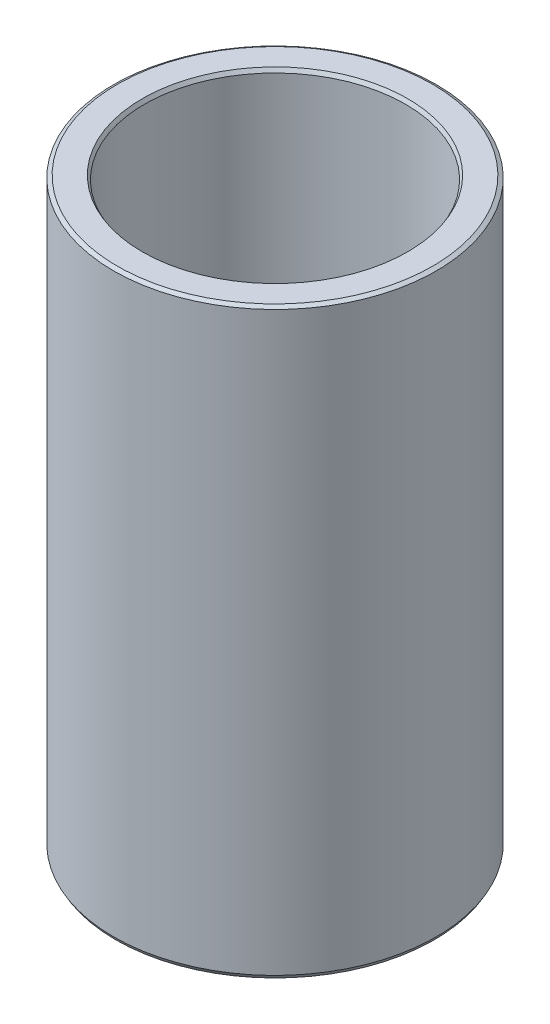
ISO-10303-21;
HEADER;
FILE_DESCRIPTION(('STEP AP214'),'2;1');
FILE_NAME('part.step','',(''),(''),'','','');
FILE_SCHEMA(('AUTOMOTIVE_DESIGN { 1 0 10303 214 1 1 1 1 }'));
ENDSEC;
DATA;
#1=APPLICATION_CONTEXT('core data for automotive mechanical design processes');
#2=APPLICATION_PROTOCOL_DEFINITION('international standard','automotive_design',2000,#1);
#3=PRODUCT_CONTEXT('',#1,'mechanical');
#4=PRODUCT('Part','Part','',(#3));
#5=PRODUCT_RELATED_PRODUCT_CATEGORY('part','',(#4));
#6=PRODUCT_DEFINITION_FORMATION('','',#4);
#7=PRODUCT_DEFINITION_CONTEXT('part definition',#1,'design');
#8=PRODUCT_DEFINITION('design','',#6,#7);
#9=PRODUCT_DEFINITION_SHAPE('','',#8);
#10=(LENGTH_UNIT() NAMED_UNIT(*) SI_UNIT(.MILLI.,.METRE.));
#11=(NAMED_UNIT(*) PLANE_ANGLE_UNIT() SI_UNIT($,.RADIAN.));
#12=(NAMED_UNIT(*) SI_UNIT($,.STERADIAN.) SOLID_ANGLE_UNIT());
#13=UNCERTAINTY_MEASURE_WITH_UNIT(LENGTH_MEASURE(1.E-05),#10,'distance_accuracy_value','');
#14=(GEOMETRIC_REPRESENTATION_CONTEXT(3) GLOBAL_UNCERTAINTY_ASSIGNED_CONTEXT((#13)) GLOBAL_UNIT_ASSIGNED_CONTEXT((#10,
#11,#12)) REPRESENTATION_CONTEXT('',''));
#15=CARTESIAN_POINT('',(0.,0.,0.));
#16=DIRECTION('',(0.,0.,1.));
#17=DIRECTION('',(1.,0.,0.));
#18=AXIS2_PLACEMENT_3D('',#15,#16,#17);
#19=CARTESIAN_POINT('',(0.,144.417892775737,0.));
#20=DIRECTION('',(0.,-1.,0.));
#21=DIRECTION('',(0.,0.,-1.));
#22=AXIS2_PLACEMENT_3D('',#19,#20,#21);
#23=CYLINDRICAL_SURFACE('',#22,40.);
#24=CARTESIAN_POINT('',(0.,0.929364566081198,0.));
#25=DIRECTION('',(0.,1.,0.));
#26=DIRECTION('',(0.,0.,1.));
#27=AXIS2_PLACEMENT_3D('',#24,#25,#26);
#28=CIRCLE('',#27,40.);
#29=CARTESIAN_POINT('',(0.,0.929364566081198,40.));
#30=VERTEX_POINT('',#29);
#31=EDGE_CURVE('E10',#30,#30,#28,.T.);
#32=ORIENTED_EDGE('',*,*,#31,.T.);
#33=EDGE_LOOP('',(#32));
#34=FACE_BOUND('',#33,.T.);
#35=CARTESIAN_POINT('',(0.,143.881323893335,0.));
#36=DIRECTION('',(0.,1.,0.));
#37=DIRECTION('',(0.,0.,1.));
#38=AXIS2_PLACEMENT_3D('',#35,#36,#37);
#39=CIRCLE('',#38,40.);
#40=CARTESIAN_POINT('',(0.,143.881323893335,-40.));
#41=VERTEX_POINT('',#40);
#42=EDGE_CURVE('E50',#41,#41,#39,.F.);
#43=ORIENTED_EDGE('',*,*,#42,.T.);
#44=EDGE_LOOP('',(#43));
#45=FACE_BOUND('',#44,.T.);
#46=ADVANCED_FACE('F39',(#34,#45),#23,.T.);
#47=CARTESIAN_POINT('',(0.,144.417892775737,0.));
#48=DIRECTION('',(0.,1.,0.));
#49=DIRECTION('',(0.,0.,1.));
#50=AXIS2_PLACEMENT_3D('',#47,#48,#49);
#51=PLANE('',#50);
#52=CARTESIAN_POINT('',(0.,144.417892775737,0.));
#53=DIRECTION('',(0.,1.,0.));
#54=DIRECTION('',(0.,0.,1.));
#55=AXIS2_PLACEMENT_3D('',#52,#53,#54);
#56=CIRCLE('',#55,32.8926343586306);
#57=CARTESIAN_POINT('',(0.,144.417892775737,32.8926343586306));
#58=VERTEX_POINT('',#57);
#59=EDGE_CURVE('E58',#58,#58,#56,.F.);
#60=ORIENTED_EDGE('',*,*,#59,.T.);
#61=EDGE_LOOP('',(#60));
#62=FACE_BOUND('',#61,.T.);
#63=CARTESIAN_POINT('',(0.,144.417892775737,0.));
#64=DIRECTION('',(0.,1.,0.));
#65=DIRECTION('',(0.,0.,1.));
#66=AXIS2_PLACEMENT_3D('',#63,#64,#65);
#67=CIRCLE('',#66,39.0706354339187);
#68=CARTESIAN_POINT('',(0.,144.417892775737,-39.0706354339187));
#69=VERTEX_POINT('',#68);
#70=EDGE_CURVE('E61',#69,#69,#67,.T.);
#71=ORIENTED_EDGE('',*,*,#70,.T.);
#72=EDGE_LOOP('',(#71));
#73=FACE_BOUND('',#72,.T.);
#74=ADVANCED_FACE('F88',(#62,#73),#51,.T.);
#75=CARTESIAN_POINT('',(0.,0.,0.));
#76=DIRECTION('',(0.,1.,0.));
#77=DIRECTION('',(0.,0.,1.));
#78=AXIS2_PLACEMENT_3D('',#75,#76,#77);
#79=PLANE('',#78);
#80=CARTESIAN_POINT('',(0.,0.,0.));
#81=DIRECTION('',(0.,1.,0.));
#82=DIRECTION('',(0.,0.,1.));
#83=AXIS2_PLACEMENT_3D('',#80,#81,#82);
#84=CIRCLE('',#83,33.2854300423095);
#85=CARTESIAN_POINT('',(0.,0.,-33.2854300423095));
#86=VERTEX_POINT('',#85);
#87=EDGE_CURVE('E51',#86,#86,#84,.T.);
#88=ORIENTED_EDGE('',*,*,#87,.T.);
#89=EDGE_LOOP('',(#88));
#90=FACE_BOUND('',#89,.T.);
#91=CARTESIAN_POINT('',(0.,0.,0.));
#92=DIRECTION('',(0.,1.,0.));
#93=DIRECTION('',(0.,0.,1.));
#94=AXIS2_PLACEMENT_3D('',#91,#92,#93);
#95=CIRCLE('',#94,39.4634311175977);
#96=CARTESIAN_POINT('',(0.,0.,39.4634311175977));
#97=VERTEX_POINT('',#96);
#98=EDGE_CURVE('E54',#97,#97,#95,.F.);
#99=ORIENTED_EDGE('',*,*,#98,.T.);
#100=EDGE_LOOP('',(#99));
#101=FACE_BOUND('',#100,.T.);
#102=ADVANCED_FACE('F83',(#90,#101),#79,.F.);
#103=CARTESIAN_POINT('',(0.,144.417892775737,0.));
#104=DIRECTION('',(0.,-1.,0.));
#105=DIRECTION('',(0.,0.,-1.));
#106=AXIS2_PLACEMENT_3D('',#103,#104,#105);
#107=CYLINDRICAL_SURFACE('',#106,32.3560654762283);
#108=CARTESIAN_POINT('',(0.,143.488528209656,0.));
#109=DIRECTION('',(0.,1.,0.));
#110=DIRECTION('',(0.,0.,1.));
#111=AXIS2_PLACEMENT_3D('',#108,#109,#110);
#112=CIRCLE('',#111,32.3560654762283);
#113=CARTESIAN_POINT('',(0.,143.488528209656,-32.3560654762283));
#114=VERTEX_POINT('',#113);
#115=EDGE_CURVE('E67',#114,#114,#112,.T.);
#116=CARTESIAN_POINT('',(0.,0.536568882402305,0.));
#117=DIRECTION('',(0.,1.,0.));
#118=DIRECTION('',(0.,0.,1.));
#119=AXIS2_PLACEMENT_3D('',#116,#117,#118);
#120=CIRCLE('',#119,32.3560654762283);
#121=CARTESIAN_POINT('',(0.,0.536568882402305,-32.3560654762283));
#122=VERTEX_POINT('',#121);
#123=EDGE_CURVE('E69',#122,#122,#120,.F.);
#124=CARTESIAN_POINT('',(0.,143.488528209656,-32.3560654762283));
#125=CARTESIAN_POINT('',(0.,141.999445299997,-32.3560654762283));
#126=CARTESIAN_POINT('',(0.,140.510362390338,-32.3560654762283));
#127=CARTESIAN_POINT('',(0.,137.53219657102,-32.3560654762283));
#128=CARTESIAN_POINT('',(0.,136.043113661362,-32.3560654762283));
#129=CARTESIAN_POINT('',(0.,133.064947842044,-32.3560654762283));
#130=CARTESIAN_POINT('',(0.,131.575864932385,-32.3560654762283));
#131=CARTESIAN_POINT('',(0.,128.597699113067,-32.3560654762283));
#132=CARTESIAN_POINT('',(0.,127.108616203408,-32.3560654762283));
#133=CARTESIAN_POINT('',(0.,124.13045038409,-32.3560654762283));
#134=CARTESIAN_POINT('',(0.,122.641367474432,-32.3560654762283));
#135=CARTESIAN_POINT('',(0.,119.663201655114,-32.3560654762283));
#136=CARTESIAN_POINT('',(0.,118.174118745455,-32.3560654762283));
#137=CARTESIAN_POINT('',(0.,115.195952926137,-32.3560654762283));
#138=CARTESIAN_POINT('',(0.,113.706870016478,-32.3560654762283));
#139=CARTESIAN_POINT('',(0.,110.72870419716,-32.3560654762283));
#140=CARTESIAN_POINT('',(0.,109.239621287501,-32.3560654762283));
#141=CARTESIAN_POINT('',(0.,106.261455468184,-32.3560654762283));
#142=CARTESIAN_POINT('',(0.,104.772372558525,-32.3560654762283));
#143=CARTESIAN_POINT('',(0.,101.794206739207,-32.3560654762283));
#144=CARTESIAN_POINT('',(0.,100.305123829548,-32.3560654762283));
#145=CARTESIAN_POINT('',(0.,97.3269580102303,-32.3560654762283));
#146=CARTESIAN_POINT('',(0.,95.8378751005714,-32.3560654762283));
#147=CARTESIAN_POINT('',(0.,92.8597092812537,-32.3560654762283));
#148=CARTESIAN_POINT('',(0.,91.3706263715948,-32.3560654762283));
#149=CARTESIAN_POINT('',(0.,88.392460552277,-32.3560654762283));
#150=CARTESIAN_POINT('',(0.,86.9033776426181,-32.3560654762283));
#151=CARTESIAN_POINT('',(0.,83.9252118233003,-32.3560654762283));
#152=CARTESIAN_POINT('',(0.,82.4361289136414,-32.3560654762283));
#153=CARTESIAN_POINT('',(0.,79.4579630943236,-32.3560654762283));
#154=CARTESIAN_POINT('',(0.,77.9688801846647,-32.3560654762283));
#155=CARTESIAN_POINT('',(0.,74.9907143653469,-32.3560654762283));
#156=CARTESIAN_POINT('',(0.,73.5016314556881,-32.3560654762283));
#157=CARTESIAN_POINT('',(0.,70.5234656363703,-32.3560654762283));
#158=CARTESIAN_POINT('',(0.,69.0343827267114,-32.3560654762283));
#159=CARTESIAN_POINT('',(0.,66.0562169073936,-32.3560654762283));
#160=CARTESIAN_POINT('',(0.,64.5671339977347,-32.3560654762283));
#161=CARTESIAN_POINT('',(0.,61.5889681784169,-32.3560654762283));
#162=CARTESIAN_POINT('',(0.,60.099885268758,-32.3560654762283));
#163=CARTESIAN_POINT('',(0.,57.1217194494402,-32.3560654762283));
#164=CARTESIAN_POINT('',(0.,55.6326365397813,-32.3560654762283));
#165=CARTESIAN_POINT('',(0.,52.6544707204636,-32.3560654762283));
#166=CARTESIAN_POINT('',(0.,51.1653878108047,-32.3560654762283));
#167=CARTESIAN_POINT('',(0.,48.1872219914869,-32.3560654762283));
#168=CARTESIAN_POINT('',(0.,46.698139081828,-32.3560654762283));
#169=CARTESIAN_POINT('',(0.,43.7199732625102,-32.3560654762283));
#170=CARTESIAN_POINT('',(0.,42.2308903528513,-32.3560654762283));
#171=CARTESIAN_POINT('',(0.,39.2527245335335,-32.3560654762283));
#172=CARTESIAN_POINT('',(0.,37.7636416238746,-32.3560654762283));
#173=CARTESIAN_POINT('',(0.,34.7854758045568,-32.3560654762283));
#174=CARTESIAN_POINT('',(0.,33.296392894898,-32.3560654762283));
#175=CARTESIAN_POINT('',(0.,30.3182270755802,-32.3560654762283));
#176=CARTESIAN_POINT('',(0.,28.8291441659213,-32.3560654762283));
#177=CARTESIAN_POINT('',(0.,25.8509783466035,-32.3560654762283));
#178=CARTESIAN_POINT('',(0.,24.3618954369446,-32.3560654762283));
#179=CARTESIAN_POINT('',(0.,21.3837296176268,-32.3560654762283));
#180=CARTESIAN_POINT('',(0.,19.8946467079679,-32.3560654762283));
#181=CARTESIAN_POINT('',(0.,16.9164808886501,-32.3560654762283));
#182=CARTESIAN_POINT('',(0.,15.4273979789912,-32.3560654762283));
#183=CARTESIAN_POINT('',(0.,12.4492321596734,-32.3560654762283));
#184=CARTESIAN_POINT('',(0.,10.9601492500146,-32.3560654762283));
#185=CARTESIAN_POINT('',(0.,7.98198343069679,-32.3560654762283));
#186=CARTESIAN_POINT('',(0.,6.49290052103789,-32.3560654762283));
#187=CARTESIAN_POINT('',(0.,3.5147347017201,-32.3560654762283));
#188=CARTESIAN_POINT('',(0.,2.0256517920612,-32.3560654762283));
#189=CARTESIAN_POINT('',(0.,0.536568882402305,-32.3560654762283));
#190=B_SPLINE_CURVE_WITH_KNOTS('',3,(#124,#125,#126,#127,#128,#129,#130,#131,#132,#133,#134,
#135,#136,#137,#138,#139,#140,#141,#142,#143,#144,#145,#146,#147,#148,#149,#150,#151,#152,#153,
#154,#155,#156,#157,#158,#159,#160,#161,#162,#163,#164,#165,#166,#167,#168,#169,#170,#171,#172,
#173,#174,#175,#176,#177,#178,#179,#180,#181,#182,#183,#184,#185,#186,#187,#188,#189),
.UNSPECIFIED.,.F.,.F.,(4,2,2,2,2,2,2,2,2,2,2,2,2,2,2,2,2,2,2,2,2,2,2,2,2,2,2,2,2,2,2,2,4),(0.,
4.46724872897669,8.93449745795338,13.40174618693,17.8689949159067,22.3362436448834,
26.8034923738601,31.2707411028368,35.7379898318134,40.2052385607901,44.6724872897668,
49.1397360187435,53.6069847477201,58.0742334766968,62.5414822056735,67.0087309346502,
71.4759796636269,75.9432283926035,80.4104771215802,84.8777258505569,89.3449745795336,
93.8122233085102,98.2794720374869,102.746720766464,107.21396949544,111.681218224417,
116.148466953394,120.61571568237,125.082964411347,129.550213140324,134.0174618693,
138.484710598277,142.951959327254),.UNSPECIFIED.);
#191=EDGE_CURVE('BSEAM71',#114,#122,#190,.T.);
#192=ORIENTED_EDGE('',*,*,#115,.T.);
#193=ORIENTED_EDGE('',*,*,#123,.T.);
#194=ORIENTED_EDGE('',*,*,#191,.T.);
#195=ORIENTED_EDGE('',*,*,#191,.F.);
#196=EDGE_LOOP('',(#192,#194,#193,#195));
#197=FACE_BOUND('',#196,.T.);
#198=ADVANCED_FACE('F71',(#197),#107,.F.);
#199=CARTESIAN_POINT('',(0.,143.488528209656,0.));
#200=DIRECTION('',(0.,1.,0.));
#201=DIRECTION('',(0.,0.,1.));
#202=AXIS2_PLACEMENT_3D('',#199,#200,#201);
#203=CONICAL_SURFACE('',#202,32.3560654762283,0.523598775598305);
#204=ORIENTED_EDGE('',*,*,#59,.F.);
#205=EDGE_LOOP('',(#204));
#206=FACE_BOUND('',#205,.T.);
#207=ORIENTED_EDGE('',*,*,#115,.F.);
#208=EDGE_LOOP('',(#207));
#209=FACE_BOUND('',#208,.T.);
#210=ADVANCED_FACE('F77',(#206,#209),#203,.F.);
#211=CARTESIAN_POINT('',(0.,0.,0.));
#212=DIRECTION('',(0.,-1.,0.));
#213=DIRECTION('',(0.,0.,-1.));
#214=AXIS2_PLACEMENT_3D('',#211,#212,#213);
#215=CONICAL_SURFACE('',#214,33.2854300423095,1.04719755119658);
#216=CARTESIAN_POINT('',(0.,0.536568882402305,-32.3560654762283));
#217=CARTESIAN_POINT('',(0.,0.530979623210616,-32.365746357125));
#218=CARTESIAN_POINT('',(0.,0.525390364018925,-32.3754272380216));
#219=CARTESIAN_POINT('',(0.,0.514211845635542,-32.394788999815));
#220=CARTESIAN_POINT('',(0.,0.508622586443851,-32.4044698807117));
#221=CARTESIAN_POINT('',(0.,0.49744406806047,-32.423831642505));
#222=CARTESIAN_POINT('',(0.,0.491854808868779,-32.4335125234017));
#223=CARTESIAN_POINT('',(0.,0.480676290485399,-32.4528742851951));
#224=CARTESIAN_POINT('',(0.,0.475087031293708,-32.4625551660918));
#225=CARTESIAN_POINT('',(0.,0.463908512910327,-32.4819169278851));
#226=CARTESIAN_POINT('',(0.,0.458319253718635,-32.4915978087818));
#227=CARTESIAN_POINT('',(0.,0.447140735335254,-32.5109595705751));
#228=CARTESIAN_POINT('',(0.,0.441551476143563,-32.5206404514718));
#229=CARTESIAN_POINT('',(0.,0.430372957760182,-32.5400022132652));
#230=CARTESIAN_POINT('',(0.,0.424783698568491,-32.5496830941619));
#231=CARTESIAN_POINT('',(0.,0.41360518018511,-32.5690448559552));
#232=CARTESIAN_POINT('',(0.,0.40801592099342,-32.5787257368519));
#233=CARTESIAN_POINT('',(0.,0.396837402610039,-32.5980874986453));
#234=CARTESIAN_POINT('',(0.,0.391248143418347,-32.6077683795419));
#235=CARTESIAN_POINT('',(0.,0.380069625034965,-32.6271301413353));
#236=CARTESIAN_POINT('',(0.,0.374480365843275,-32.636811022232));
#237=CARTESIAN_POINT('',(0.,0.363301847459894,-32.6561727840253));
#238=CARTESIAN_POINT('',(0.,0.357712588268204,-32.665853664922));
#239=CARTESIAN_POINT('',(0.,0.346534069884822,-32.6852154267154));
#240=CARTESIAN_POINT('',(0.,0.340944810693131,-32.6948963076121));
#241=CARTESIAN_POINT('',(0.,0.329766292309749,-32.7142580694054));
#242=CARTESIAN_POINT('',(0.,0.324177033118059,-32.7239389503021));
#243=CARTESIAN_POINT('',(0.,0.312998514734678,-32.7433007120955));
#244=CARTESIAN_POINT('',(0.,0.307409255542988,-32.7529815929921));
#245=CARTESIAN_POINT('',(0.,0.296230737159606,-32.7723433547855));
#246=CARTESIAN_POINT('',(0.,0.290641477967915,-32.7820242356822));
#247=CARTESIAN_POINT('',(0.,0.279462959584533,-32.8013859974755));
#248=CARTESIAN_POINT('',(0.,0.273873700392843,-32.8110668783722));
#249=CARTESIAN_POINT('',(0.,0.262695182009462,-32.8304286401656));
#250=CARTESIAN_POINT('',(0.,0.257105922817772,-32.8401095210622));
#251=CARTESIAN_POINT('',(0.,0.24592740443439,-32.8594712828556));
#252=CARTESIAN_POINT('',(0.,0.240338145242699,-32.8691521637523));
#253=CARTESIAN_POINT('',(0.,0.229159626859317,-32.8885139255456));
#254=CARTESIAN_POINT('',(0.,0.223570367667627,-32.8981948064423));
#255=CARTESIAN_POINT('',(0.,0.212391849284246,-32.9175565682357));
#256=CARTESIAN_POINT('',(0.,0.206802590092556,-32.9272374491324));
#257=CARTESIAN_POINT('',(0.,0.195624071709174,-32.9465992109257));
#258=CARTESIAN_POINT('',(0.,0.190034812517483,-32.9562800918224));
#259=CARTESIAN_POINT('',(0.,0.178856294134101,-32.9756418536158));
#260=CARTESIAN_POINT('',(0.,0.173267034942411,-32.9853227345124));
#261=CARTESIAN_POINT('',(0.,0.16208851655903,-33.0046844963058));
#262=CARTESIAN_POINT('',(0.,0.156499257367339,-33.0143653772025));
#263=CARTESIAN_POINT('',(0.,0.145320738983958,-33.0337271389958));
#264=CARTESIAN_POINT('',(0.,0.139731479792268,-33.0434080198925));
#265=CARTESIAN_POINT('',(0.,0.128552961408886,-33.0627697816859));
#266=CARTESIAN_POINT('',(0.,0.122963702217195,-33.0724506625825));
#267=CARTESIAN_POINT('',(0.,0.111785183833813,-33.0918124243759));
#268=CARTESIAN_POINT('',(0.,0.106195924642123,-33.1014933052726));
#269=CARTESIAN_POINT('',(0.,0.0950174062587419,-33.1208550670659));
#270=CARTESIAN_POINT('',(0.,0.0894281470670515,-33.1305359479626));
#271=CARTESIAN_POINT('',(0.,0.0782496286836698,-33.149897709756));
#272=CARTESIAN_POINT('',(0.,0.0726603694919785,-33.1595785906527));
#273=CARTESIAN_POINT('',(0.,0.0614818511085968,-33.178940352446));
#274=CARTESIAN_POINT('',(0.,0.0558925919169065,-33.1886212333427));
#275=CARTESIAN_POINT('',(0.,0.0447140735335257,-33.2079829951361));
#276=CARTESIAN_POINT('',(0.,0.0391248143418353,-33.2176638760327));
#277=CARTESIAN_POINT('',(0.,0.0279462959584538,-33.2370256378261));
#278=CARTESIAN_POINT('',(0.,0.0223570367667627,-33.2467065187228));
#279=CARTESIAN_POINT('',(0.,0.0111785183833804,-33.2660682805161));
#280=CARTESIAN_POINT('',(0.,0.00558925919168928,-33.2757491614128));
#281=CARTESIAN_POINT('',(0.,0.,-33.2854300423095));
#282=B_SPLINE_CURVE_WITH_KNOTS('',3,(#216,#217,#218,#219,#220,#221,#222,#223,#224,#225,#226,
#227,#228,#229,#230,#231,#232,#233,#234,#235,#236,#237,#238,#239,#240,#241,#242,#243,#244,#245,
#246,#247,#248,#249,#250,#251,#252,#253,#254,#255,#256,#257,#258,#259,#260,#261,#262,#263,#264,
#265,#266,#267,#268,#269,#270,#271,#272,#273,#274,#275,#276,#277,#278,#279,#280,#281),
.UNSPECIFIED.,.F.,.F.,(4,2,2,2,2,2,2,2,2,2,2,2,2,2,2,2,2,2,2,2,2,2,2,2,2,2,2,2,2,2,2,2,4),(0.,
0.0335355551501451,0.0670711103002842,0.100606665450429,0.134142220600574,0.167677775750714,
0.201213330900859,0.234748886051004,0.268284441201149,0.301819996351288,0.335355551501433,
0.368891106651578,0.402426661801717,0.435962216951862,0.469497772102007,0.503033327252147,
0.536568882402292,0.570104437552437,0.603639992702576,0.637175547852721,0.670711103002866,
0.704246658153005,0.737782213303151,0.771317768453296,0.804853323603441,0.83838887875358,
0.871924433903725,0.90545998905387,0.938995544204009,0.972531099354154,1.0060666545043,
1.03960220965444,1.07313776480458),.UNSPECIFIED.);
#283=EDGE_CURVE('BSEAM73',#122,#86,#282,.T.);
#284=ORIENTED_EDGE('',*,*,#123,.F.);
#285=ORIENTED_EDGE('',*,*,#87,.F.);
#286=ORIENTED_EDGE('',*,*,#283,.T.);
#287=ORIENTED_EDGE('',*,*,#283,.F.);
#288=EDGE_LOOP('',(#284,#286,#285,#287));
#289=FACE_BOUND('',#288,.T.);
#290=ADVANCED_FACE('F73',(#289),#215,.F.);
#291=CARTESIAN_POINT('',(0.,0.929364566081198,0.));
#292=DIRECTION('',(0.,1.,0.));
#293=DIRECTION('',(0.,0.,1.));
#294=AXIS2_PLACEMENT_3D('',#291,#292,#293);
#295=CONICAL_SURFACE('',#294,40.,0.52359877559832);
#296=ORIENTED_EDGE('',*,*,#98,.F.);
#297=EDGE_LOOP('',(#296));
#298=FACE_BOUND('',#297,.T.);
#299=ORIENTED_EDGE('',*,*,#31,.F.);
#300=EDGE_LOOP('',(#299));
#301=FACE_BOUND('',#300,.T.);
#302=ADVANCED_FACE('F76',(#298,#301),#295,.T.);
#303=CARTESIAN_POINT('',(0.,144.417892775737,0.));
#304=DIRECTION('',(0.,-1.,0.));
#305=DIRECTION('',(0.,0.,-1.));
#306=AXIS2_PLACEMENT_3D('',#303,#304,#305);
#307=CONICAL_SURFACE('',#306,39.0706354339187,1.0471975511966);
#308=CARTESIAN_POINT('',(0.,143.881323893335,-40.));
#309=CARTESIAN_POINT('',(0.,143.886913152527,-39.9903191191033));
#310=CARTESIAN_POINT('',(0.,143.892502411718,-39.9806382382067));
#311=CARTESIAN_POINT('',(0.,143.903680930102,-39.9612764764133));
#312=CARTESIAN_POINT('',(0.,143.909270189293,-39.9515955955166));
#313=CARTESIAN_POINT('',(0.,143.920448707677,-39.9322338337233));
#314=CARTESIAN_POINT('',(0.,143.926037966868,-39.9225529528266));
#315=CARTESIAN_POINT('',(0.,143.937216485252,-39.9031911910332));
#316=CARTESIAN_POINT('',(0.,143.942805744444,-39.8935103101365));
#317=CARTESIAN_POINT('',(0.,143.953984262827,-39.8741485483432));
#318=CARTESIAN_POINT('',(0.,143.959573522019,-39.8644676674465));
#319=CARTESIAN_POINT('',(0.,143.970752040402,-39.8451059056531));
#320=CARTESIAN_POINT('',(0.,143.976341299594,-39.8354250247565));
#321=CARTESIAN_POINT('',(0.,143.987519817977,-39.8160632629631));
#322=CARTESIAN_POINT('',(0.,143.993109077169,-39.8063823820664));
#323=CARTESIAN_POINT('',(0.,144.004287595552,-39.7870206202731));
#324=CARTESIAN_POINT('',(0.,144.009876854744,-39.7773397393764));
#325=CARTESIAN_POINT('',(0.,144.021055373127,-39.757977977583));
#326=CARTESIAN_POINT('',(0.,144.026644632319,-39.7482970966863));
#327=CARTESIAN_POINT('',(0.,144.037823150702,-39.728935334893));
#328=CARTESIAN_POINT('',(0.,144.043412409894,-39.7192544539963));
#329=CARTESIAN_POINT('',(0.,144.054590928277,-39.6998926922029));
#330=CARTESIAN_POINT('',(0.,144.060180187469,-39.6902118113063));
#331=CARTESIAN_POINT('',(0.,144.071358705852,-39.6708500495129));
#332=CARTESIAN_POINT('',(0.,144.076947965044,-39.6611691686162));
#333=CARTESIAN_POINT('',(0.,144.088126483428,-39.6418074068229));
#334=CARTESIAN_POINT('',(0.,144.093715742619,-39.6321265259262));
#335=CARTESIAN_POINT('',(0.,144.104894261003,-39.6127647641328));
#336=CARTESIAN_POINT('',(0.,144.110483520194,-39.6030838832361));
#337=CARTESIAN_POINT('',(0.,144.121662038578,-39.5837221214428));
#338=CARTESIAN_POINT('',(0.,144.127251297769,-39.5740412405461));
#339=CARTESIAN_POINT('',(0.,144.138429816153,-39.5546794787527));
#340=CARTESIAN_POINT('',(0.,144.144019075344,-39.5449985978561));
#341=CARTESIAN_POINT('',(0.,144.155197593728,-39.5256368360627));
#342=CARTESIAN_POINT('',(0.,144.160786852919,-39.515955955166));
#343=CARTESIAN_POINT('',(0.,144.171965371303,-39.4965941933727));
#344=CARTESIAN_POINT('',(0.,144.177554630495,-39.486913312476));
#345=CARTESIAN_POINT('',(0.,144.188733148878,-39.4675515506826));
#346=CARTESIAN_POINT('',(0.,144.19432240807,-39.4578706697859));
#347=CARTESIAN_POINT('',(0.,144.205500926453,-39.4385089079926));
#348=CARTESIAN_POINT('',(0.,144.211090185645,-39.4288280270959));
#349=CARTESIAN_POINT('',(0.,144.222268704028,-39.4094662653025));
#350=CARTESIAN_POINT('',(0.,144.22785796322,-39.3997853844059));
#351=CARTESIAN_POINT('',(0.,144.239036481603,-39.3804236226125));
#352=CARTESIAN_POINT('',(0.,144.244625740795,-39.3707427417158));
#353=CARTESIAN_POINT('',(0.,144.255804259178,-39.3513809799224));
#354=CARTESIAN_POINT('',(0.,144.26139351837,-39.3417000990258));
#355=CARTESIAN_POINT('',(0.,144.272572036753,-39.3223383372324));
#356=CARTESIAN_POINT('',(0.,144.278161295945,-39.3126574563357));
#357=CARTESIAN_POINT('',(0.,144.289339814328,-39.2932956945424));
#358=CARTESIAN_POINT('',(0.,144.29492907352,-39.2836148136457));
#359=CARTESIAN_POINT('',(0.,144.306107591903,-39.2642530518523));
#360=CARTESIAN_POINT('',(0.,144.311696851095,-39.2545721709556));
#361=CARTESIAN_POINT('',(0.,144.322875369479,-39.2352104091623));
#362=CARTESIAN_POINT('',(0.,144.32846462867,-39.2255295282656));
#363=CARTESIAN_POINT('',(0.,144.339643147054,-39.2061677664722));
#364=CARTESIAN_POINT('',(0.,144.345232406245,-39.1964868855756));
#365=CARTESIAN_POINT('',(0.,144.356410924629,-39.1771251237822));
#366=CARTESIAN_POINT('',(0.,144.36200018382,-39.1674442428855));
#367=CARTESIAN_POINT('',(0.,144.373178702204,-39.1480824810922));
#368=CARTESIAN_POINT('',(0.,144.378767961395,-39.1384016001955));
#369=CARTESIAN_POINT('',(0.,144.389946479779,-39.1190398384021));
#370=CARTESIAN_POINT('',(0.,144.39553573897,-39.1093589575054));
#371=CARTESIAN_POINT('',(0.,144.406714257354,-39.0899971957121));
#372=CARTESIAN_POINT('',(0.,144.412303516546,-39.0803163148154));
#373=CARTESIAN_POINT('',(0.,144.417892775737,-39.0706354339187));
#374=B_SPLINE_CURVE_WITH_KNOTS('',3,(#308,#309,#310,#311,#312,#313,#314,#315,#316,#317,#318,
#319,#320,#321,#322,#323,#324,#325,#326,#327,#328,#329,#330,#331,#332,#333,#334,#335,#336,#337,
#338,#339,#340,#341,#342,#343,#344,#345,#346,#347,#348,#349,#350,#351,#352,#353,#354,#355,#356,
#357,#358,#359,#360,#361,#362,#363,#364,#365,#366,#367,#368,#369,#370,#371,#372,#373),
.UNSPECIFIED.,.F.,.F.,(4,2,2,2,2,2,2,2,2,2,2,2,2,2,2,2,2,2,2,2,2,2,2,2,2,2,2,2,2,2,2,2,4),(0.,
0.0335355551501395,0.067071110300279,0.100606665450432,0.134142220600572,0.167677775750725,
0.201213330900865,0.234748886051018,0.268284441201157,0.301819996351297,0.33535555150145,
0.368891106651596,0.402426661801749,0.435962216951889,0.469497772102042,0.503033327252181,
0.536568882402335,0.570104437552474,0.603639992702614,0.637175547852767,0.670711103002907,
0.704246658153066,0.737782213303206,0.771317768453359,0.804853323603498,0.838388878753638,
0.871924433903791,0.905459989053931,0.938995544204084,0.972531099354224,1.00606665450438,
1.03960220965452,1.07313776480468),.UNSPECIFIED.);
#375=EDGE_CURVE('BSEAM45',#41,#69,#374,.T.);
#376=ORIENTED_EDGE('',*,*,#42,.F.);
#377=ORIENTED_EDGE('',*,*,#70,.F.);
#378=ORIENTED_EDGE('',*,*,#375,.T.);
#379=ORIENTED_EDGE('',*,*,#375,.F.);
#380=EDGE_LOOP('',(#376,#378,#377,#379));
#381=FACE_BOUND('',#380,.T.);
#382=ADVANCED_FACE('F45',(#381),#307,.T.);
#383=CLOSED_SHELL('',(#46,#74,#102,#198,#210,#290,#302,#382));
#384=MANIFOLD_SOLID_BREP('B2',#383);
#385=ADVANCED_BREP_SHAPE_REPRESENTATION('',(#18,#384),#14);
#386=SHAPE_DEFINITION_REPRESENTATION(#9,#385);
ENDSEC;
END-ISO-10303-21;
